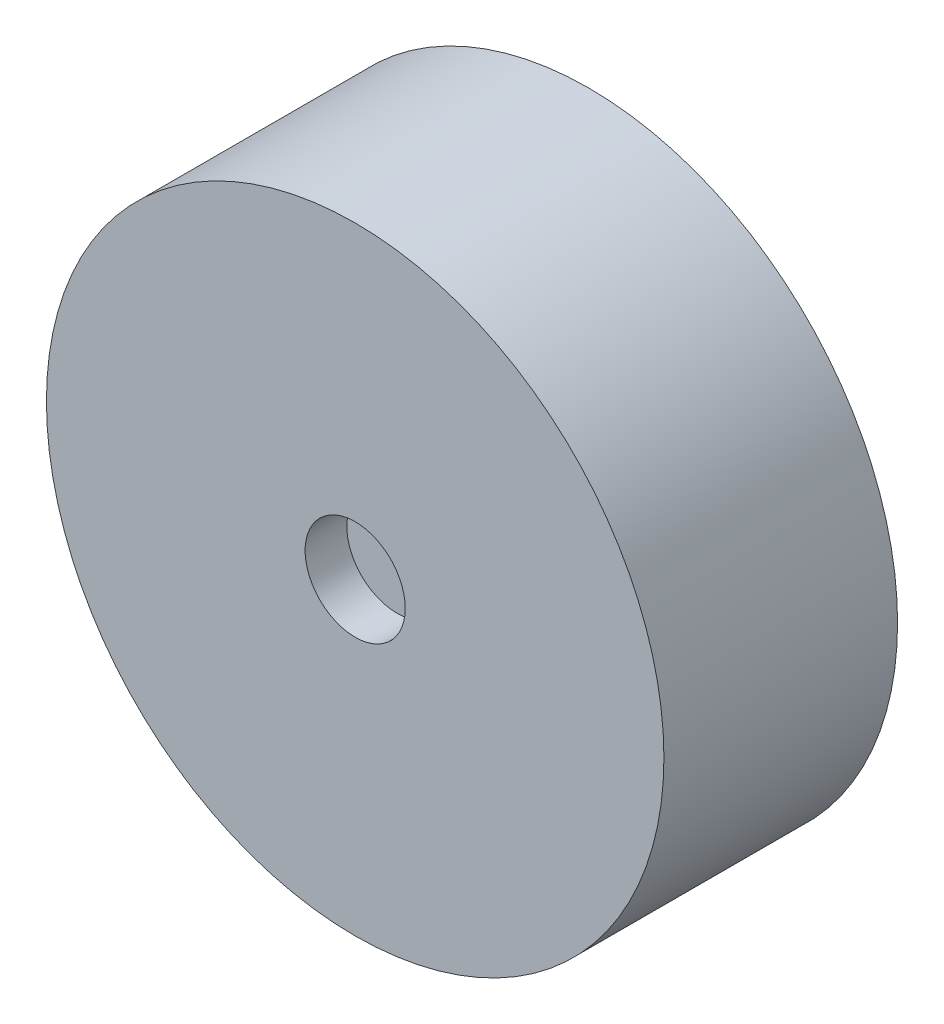
ISO-10303-21;
HEADER;
FILE_DESCRIPTION(('STEP AP214'),'2;1');
FILE_NAME('part.step','',(''),(''),'','','');
FILE_SCHEMA(('AUTOMOTIVE_DESIGN { 1 0 10303 214 1 1 1 1 }'));
ENDSEC;
DATA;
#1=APPLICATION_CONTEXT('core data for automotive mechanical design processes');
#2=APPLICATION_PROTOCOL_DEFINITION('international standard','automotive_design',2000,#1);
#3=PRODUCT_CONTEXT('',#1,'mechanical');
#4=PRODUCT('Part','Part','',(#3));
#5=PRODUCT_RELATED_PRODUCT_CATEGORY('part','',(#4));
#6=PRODUCT_DEFINITION_FORMATION('','',#4);
#7=PRODUCT_DEFINITION_CONTEXT('part definition',#1,'design');
#8=PRODUCT_DEFINITION('design','',#6,#7);
#9=PRODUCT_DEFINITION_SHAPE('','',#8);
#10=(LENGTH_UNIT() NAMED_UNIT(*) SI_UNIT(.MILLI.,.METRE.));
#11=(NAMED_UNIT(*) PLANE_ANGLE_UNIT() SI_UNIT($,.RADIAN.));
#12=(NAMED_UNIT(*) SI_UNIT($,.STERADIAN.) SOLID_ANGLE_UNIT());
#13=UNCERTAINTY_MEASURE_WITH_UNIT(LENGTH_MEASURE(1.E-05),#10,'distance_accuracy_value','');
#14=(GEOMETRIC_REPRESENTATION_CONTEXT(3) GLOBAL_UNCERTAINTY_ASSIGNED_CONTEXT((#13)) GLOBAL_UNIT_ASSIGNED_CONTEXT((#10,
#11,#12)) REPRESENTATION_CONTEXT('',''));
#15=CARTESIAN_POINT('',(0.,0.,0.));
#16=DIRECTION('',(0.,0.,1.));
#17=DIRECTION('',(1.,0.,0.));
#18=AXIS2_PLACEMENT_3D('',#15,#16,#17);
#19=CARTESIAN_POINT('',(0.,0.,14.));
#20=DIRECTION('',(0.,0.,-1.));
#21=DIRECTION('',(-1.,0.,0.));
#22=AXIS2_PLACEMENT_3D('',#19,#20,#21);
#23=CYLINDRICAL_SURFACE('',#22,18.5);
#24=CARTESIAN_POINT('',(0.,0.,14.));
#25=DIRECTION('',(0.,0.,1.));
#26=DIRECTION('',(1.,0.,0.));
#27=AXIS2_PLACEMENT_3D('',#24,#25,#26);
#28=CIRCLE('',#27,18.5);
#29=CARTESIAN_POINT('',(18.5,0.,14.));
#30=VERTEX_POINT('',#29);
#31=EDGE_CURVE('E10',#30,#30,#28,.T.);
#32=ORIENTED_EDGE('',*,*,#31,.F.);
#33=EDGE_LOOP('',(#32));
#34=FACE_BOUND('',#33,.T.);
#35=CARTESIAN_POINT('',(0.,0.,0.));
#36=DIRECTION('',(0.,0.,1.));
#37=DIRECTION('',(1.,0.,0.));
#38=AXIS2_PLACEMENT_3D('',#35,#36,#37);
#39=CIRCLE('',#38,18.5);
#40=CARTESIAN_POINT('',(18.5,0.,0.));
#41=VERTEX_POINT('',#40);
#42=EDGE_CURVE('E44',#41,#41,#39,.T.);
#43=ORIENTED_EDGE('',*,*,#42,.T.);
#44=EDGE_LOOP('',(#43));
#45=FACE_BOUND('',#44,.T.);
#46=ADVANCED_FACE('F41',(#34,#45),#23,.T.);
#47=CARTESIAN_POINT('',(0.,0.,14.));
#48=DIRECTION('',(0.,0.,1.));
#49=DIRECTION('',(1.,0.,0.));
#50=AXIS2_PLACEMENT_3D('',#47,#48,#49);
#51=PLANE('',#50);
#52=CARTESIAN_POINT('',(0.,0.,14.));
#53=DIRECTION('',(0.,0.,1.));
#54=DIRECTION('',(1.,0.,0.));
#55=AXIS2_PLACEMENT_3D('',#52,#53,#54);
#56=CIRCLE('',#55,3.);
#57=CARTESIAN_POINT('',(3.,0.,14.));
#58=VERTEX_POINT('',#57);
#59=EDGE_CURVE('E63',#58,#58,#56,.T.);
#60=ORIENTED_EDGE('',*,*,#59,.F.);
#61=EDGE_LOOP('',(#60));
#62=FACE_BOUND('',#61,.T.);
#63=ORIENTED_EDGE('',*,*,#31,.T.);
#64=EDGE_LOOP('',(#63));
#65=FACE_BOUND('',#64,.T.);
#66=ADVANCED_FACE('F80',(#62,#65),#51,.T.);
#67=CARTESIAN_POINT('',(0.,0.,0.));
#68=DIRECTION('',(0.,0.,1.));
#69=DIRECTION('',(1.,0.,0.));
#70=AXIS2_PLACEMENT_3D('',#67,#68,#69);
#71=PLANE('',#70);
#72=CARTESIAN_POINT('',(0.,0.,0.));
#73=DIRECTION('',(0.,0.,-1.));
#74=DIRECTION('',(-1.,0.,0.));
#75=AXIS2_PLACEMENT_3D('',#72,#73,#74);
#76=CIRCLE('',#75,3.);
#77=CARTESIAN_POINT('',(-3.,0.,0.));
#78=VERTEX_POINT('',#77);
#79=EDGE_CURVE('E55',#78,#78,#76,.T.);
#80=ORIENTED_EDGE('',*,*,#79,.F.);
#81=EDGE_LOOP('',(#80));
#82=FACE_BOUND('',#81,.T.);
#83=ORIENTED_EDGE('',*,*,#42,.F.);
#84=EDGE_LOOP('',(#83));
#85=FACE_BOUND('',#84,.T.);
#86=ADVANCED_FACE('F82',(#82,#85),#71,.F.);
#87=CARTESIAN_POINT('',(0.,0.,2.5));
#88=DIRECTION('',(0.,0.,-1.));
#89=DIRECTION('',(-1.,0.,0.));
#90=AXIS2_PLACEMENT_3D('',#87,#88,#89);
#91=CYLINDRICAL_SURFACE('',#90,3.);
#92=CARTESIAN_POINT('',(0.,0.,2.5));
#93=DIRECTION('',(0.,0.,-1.));
#94=DIRECTION('',(-1.,0.,0.));
#95=AXIS2_PLACEMENT_3D('',#92,#93,#94);
#96=CIRCLE('',#95,3.);
#97=CARTESIAN_POINT('',(-3.,0.,2.5));
#98=VERTEX_POINT('',#97);
#99=EDGE_CURVE('E53',#98,#98,#96,.T.);
#100=ORIENTED_EDGE('',*,*,#99,.F.);
#101=EDGE_LOOP('',(#100));
#102=FACE_BOUND('',#101,.T.);
#103=ORIENTED_EDGE('',*,*,#79,.T.);
#104=EDGE_LOOP('',(#103));
#105=FACE_BOUND('',#104,.T.);
#106=ADVANCED_FACE('F89',(#102,#105),#91,.F.);
#107=CARTESIAN_POINT('',(0.,0.,2.5));
#108=DIRECTION('',(0.,0.,-1.));
#109=DIRECTION('',(-1.,0.,0.));
#110=AXIS2_PLACEMENT_3D('',#107,#108,#109);
#111=PLANE('',#110);
#112=ORIENTED_EDGE('',*,*,#99,.T.);
#113=EDGE_LOOP('',(#112));
#114=FACE_BOUND('',#113,.T.);
#115=ADVANCED_FACE('F76',(#114),#111,.T.);
#116=CARTESIAN_POINT('',(0.,0.,11.5));
#117=DIRECTION('',(0.,0.,1.));
#118=DIRECTION('',(1.,0.,0.));
#119=AXIS2_PLACEMENT_3D('',#116,#117,#118);
#120=CYLINDRICAL_SURFACE('',#119,3.);
#121=CARTESIAN_POINT('',(0.,0.,11.5));
#122=DIRECTION('',(0.,0.,1.));
#123=DIRECTION('',(1.,0.,0.));
#124=AXIS2_PLACEMENT_3D('',#121,#122,#123);
#125=CIRCLE('',#124,3.);
#126=CARTESIAN_POINT('',(3.,0.,11.5));
#127=VERTEX_POINT('',#126);
#128=EDGE_CURVE('E59',#127,#127,#125,.T.);
#129=ORIENTED_EDGE('',*,*,#128,.F.);
#130=EDGE_LOOP('',(#129));
#131=FACE_BOUND('',#130,.T.);
#132=ORIENTED_EDGE('',*,*,#59,.T.);
#133=EDGE_LOOP('',(#132));
#134=FACE_BOUND('',#133,.T.);
#135=ADVANCED_FACE('F73',(#131,#134),#120,.F.);
#136=CARTESIAN_POINT('',(0.,0.,11.5));
#137=DIRECTION('',(0.,0.,1.));
#138=DIRECTION('',(1.,0.,0.));
#139=AXIS2_PLACEMENT_3D('',#136,#137,#138);
#140=PLANE('',#139);
#141=ORIENTED_EDGE('',*,*,#128,.T.);
#142=EDGE_LOOP('',(#141));
#143=FACE_BOUND('',#142,.T.);
#144=ADVANCED_FACE('F71',(#143),#140,.T.);
#145=CLOSED_SHELL('',(#46,#66,#86,#106,#115,#135,#144));
#146=MANIFOLD_SOLID_BREP('B2',#145);
#147=ADVANCED_BREP_SHAPE_REPRESENTATION('',(#18,#146),#14);
#148=SHAPE_DEFINITION_REPRESENTATION(#9,#147);
ENDSEC;
END-ISO-10303-21;
